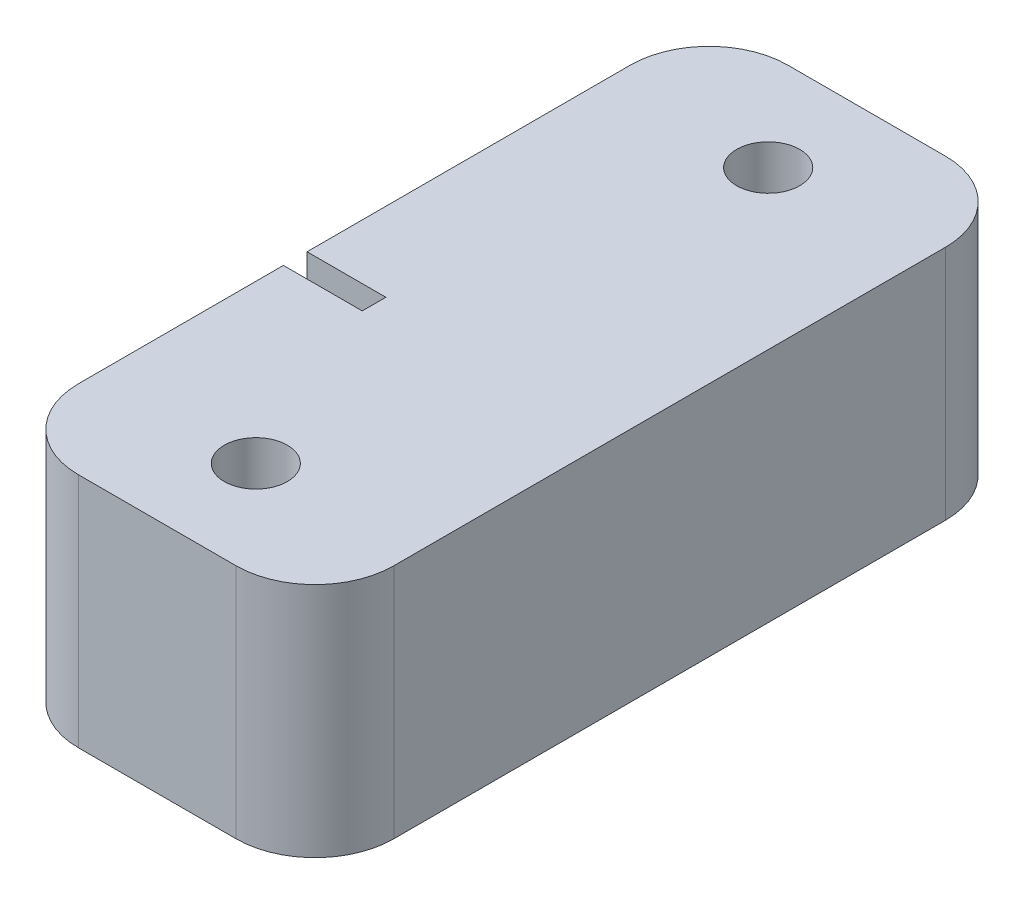
ISO-10303-21;
HEADER;
FILE_DESCRIPTION(('STEP AP214'),'2;1');
FILE_NAME('part.step','',(''),(''),'','','');
FILE_SCHEMA(('AUTOMOTIVE_DESIGN { 1 0 10303 214 1 1 1 1 }'));
ENDSEC;
DATA;
#1=APPLICATION_CONTEXT('core data for automotive mechanical design processes');
#2=APPLICATION_PROTOCOL_DEFINITION('international standard','automotive_design',2000,#1);
#3=PRODUCT_CONTEXT('',#1,'mechanical');
#4=PRODUCT('Part','Part','',(#3));
#5=PRODUCT_RELATED_PRODUCT_CATEGORY('part','',(#4));
#6=PRODUCT_DEFINITION_FORMATION('','',#4);
#7=PRODUCT_DEFINITION_CONTEXT('part definition',#1,'design');
#8=PRODUCT_DEFINITION('design','',#6,#7);
#9=PRODUCT_DEFINITION_SHAPE('','',#8);
#10=(LENGTH_UNIT() NAMED_UNIT(*) SI_UNIT(.MILLI.,.METRE.));
#11=(NAMED_UNIT(*) PLANE_ANGLE_UNIT() SI_UNIT($,.RADIAN.));
#12=(NAMED_UNIT(*) SI_UNIT($,.STERADIAN.) SOLID_ANGLE_UNIT());
#13=UNCERTAINTY_MEASURE_WITH_UNIT(LENGTH_MEASURE(1.E-05),#10,'distance_accuracy_value','');
#14=(GEOMETRIC_REPRESENTATION_CONTEXT(3) GLOBAL_UNCERTAINTY_ASSIGNED_CONTEXT((#13)) GLOBAL_UNIT_ASSIGNED_CONTEXT((#10,
#11,#12)) REPRESENTATION_CONTEXT('',''));
#15=CARTESIAN_POINT('',(0.,0.,0.));
#16=DIRECTION('',(0.,0.,1.));
#17=DIRECTION('',(1.,0.,0.));
#18=AXIS2_PLACEMENT_3D('',#15,#16,#17);
#19=CARTESIAN_POINT('',(-23.5223880597015,30.,-49.7611940298507));
#20=DIRECTION('',(1.,0.,0.));
#21=DIRECTION('',(0.,0.,-1.));
#22=AXIS2_PLACEMENT_3D('',#19,#20,#21);
#23=PLANE('',#22);
#24=DIRECTION('',(0.,0.,1.));
#25=VECTOR('',#24,1.);
#26=CARTESIAN_POINT('',(-23.5223880597015,30.,-49.7611940298507));
#27=LINE('',#26,#25);
#28=CARTESIAN_POINT('',(-23.5223880597015,30.,-39.7611940298507));
#29=VERTEX_POINT('',#28);
#30=CARTESIAN_POINT('',(-23.5223880597015,30.,1.23880597014926));
#31=VERTEX_POINT('',#30);
#32=EDGE_CURVE('E182',#29,#31,#27,.T.);
#33=ORIENTED_EDGE('',*,*,#32,.F.);
#34=DIRECTION('',(0.,-1.,0.));
#35=VECTOR('',#34,1.);
#36=CARTESIAN_POINT('',(-23.5223880597015,30.,-39.7611940298507));
#37=LINE('',#36,#35);
#38=CARTESIAN_POINT('',(-23.5223880597015,0.,-39.7611940298507));
#39=VERTEX_POINT('',#38);
#40=EDGE_CURVE('E204',#29,#39,#37,.T.);
#41=ORIENTED_EDGE('',*,*,#40,.T.);
#42=DIRECTION('',(0.,0.,1.));
#43=VECTOR('',#42,1.);
#44=CARTESIAN_POINT('',(-23.5223880597015,0.,-49.7611940298507));
#45=LINE('',#44,#43);
#46=CARTESIAN_POINT('',(-23.5223880597015,0.,30.2388059701492));
#47=VERTEX_POINT('',#46);
#48=EDGE_CURVE('E173',#39,#47,#45,.T.);
#49=ORIENTED_EDGE('',*,*,#48,.T.);
#50=DIRECTION('',(0.,-1.,0.));
#51=VECTOR('',#50,1.);
#52=CARTESIAN_POINT('',(-23.5223880597015,30.,30.2388059701492));
#53=LINE('',#52,#51);
#54=CARTESIAN_POINT('',(-23.5223880597015,30.,30.2388059701492));
#55=VERTEX_POINT('',#54);
#56=EDGE_CURVE('E192',#47,#55,#53,.F.);
#57=ORIENTED_EDGE('',*,*,#56,.T.);
#58=CARTESIAN_POINT('',(-23.5223880597015,30.,4.23880597014926));
#59=VERTEX_POINT('',#58);
#60=EDGE_CURVE('E185',#59,#55,#27,.T.);
#61=ORIENTED_EDGE('',*,*,#60,.F.);
#62=DIRECTION('',(0.,-1.,0.));
#63=VECTOR('',#62,1.);
#64=CARTESIAN_POINT('',(-23.5223880597015,0.,4.23880597014926));
#65=LINE('',#64,#63);
#66=CARTESIAN_POINT('',(-23.5223880597015,18.7080992435478,4.23880597014926));
#67=VERTEX_POINT('',#66);
#68=EDGE_CURVE('E151',#59,#67,#65,.T.);
#69=ORIENTED_EDGE('',*,*,#68,.T.);
#70=CARTESIAN_POINT('',(-23.5223880597015,15.,2.73880597014926));
#71=DIRECTION('',(-1.,0.,0.));
#72=DIRECTION('',(0.,0.,1.));
#73=AXIS2_PLACEMENT_3D('',#70,#71,#72);
#74=CIRCLE('',#73,4.);
#75=CARTESIAN_POINT('',(-23.5223880597015,18.7080992435478,1.23880597014926));
#76=VERTEX_POINT('',#75);
#77=EDGE_CURVE('E159',#76,#67,#74,.T.);
#78=ORIENTED_EDGE('',*,*,#77,.F.);
#79=DIRECTION('',(0.,-1.,0.));
#80=VECTOR('',#79,1.);
#81=CARTESIAN_POINT('',(-23.5223880597015,0.,1.23880597014926));
#82=LINE('',#81,#80);
#83=EDGE_CURVE('E129',#31,#76,#82,.T.);
#84=ORIENTED_EDGE('',*,*,#83,.F.);
#85=EDGE_LOOP('',(#33,#41,#49,#57,#61,#69,#78,#84));
#86=FACE_BOUND('',#85,.T.);
#87=ADVANCED_FACE('F32',(#86),#23,.F.);
#88=CARTESIAN_POINT('',(-23.5223880597015,30.,40.2388059701493));
#89=DIRECTION('',(0.,0.,-1.));
#90=DIRECTION('',(-1.,0.,0.));
#91=AXIS2_PLACEMENT_3D('',#88,#89,#90);
#92=PLANE('',#91);
#93=DIRECTION('',(1.,0.,0.));
#94=VECTOR('',#93,1.);
#95=CARTESIAN_POINT('',(-23.5223880597015,0.,40.2388059701493));
#96=LINE('',#95,#94);
#97=CARTESIAN_POINT('',(-13.5223880597015,0.,40.2388059701493));
#98=VERTEX_POINT('',#97);
#99=CARTESIAN_POINT('',(6.47761194029854,0.,40.2388059701493));
#100=VERTEX_POINT('',#99);
#101=EDGE_CURVE('E195',#98,#100,#96,.T.);
#102=ORIENTED_EDGE('',*,*,#101,.T.);
#103=DIRECTION('',(0.,-1.,0.));
#104=VECTOR('',#103,1.);
#105=CARTESIAN_POINT('',(6.47761194029854,30.,40.2388059701493));
#106=LINE('',#105,#104);
#107=CARTESIAN_POINT('',(6.47761194029854,30.,40.2388059701493));
#108=VERTEX_POINT('',#107);
#109=EDGE_CURVE('E11',#100,#108,#106,.F.);
#110=ORIENTED_EDGE('',*,*,#109,.T.);
#111=DIRECTION('',(1.,0.,0.));
#112=VECTOR('',#111,1.);
#113=CARTESIAN_POINT('',(-23.5223880597015,30.,40.2388059701493));
#114=LINE('',#113,#112);
#115=CARTESIAN_POINT('',(-13.5223880597015,30.,40.2388059701493));
#116=VERTEX_POINT('',#115);
#117=EDGE_CURVE('E184',#116,#108,#114,.T.);
#118=ORIENTED_EDGE('',*,*,#117,.F.);
#119=DIRECTION('',(0.,-1.,0.));
#120=VECTOR('',#119,1.);
#121=CARTESIAN_POINT('',(-13.5223880597015,30.,40.2388059701493));
#122=LINE('',#121,#120);
#123=EDGE_CURVE('E40',#116,#98,#122,.T.);
#124=ORIENTED_EDGE('',*,*,#123,.T.);
#125=EDGE_LOOP('',(#102,#110,#118,#124));
#126=FACE_BOUND('',#125,.T.);
#127=ADVANCED_FACE('F235',(#126),#92,.F.);
#128=CARTESIAN_POINT('',(16.4776119402985,30.,-49.7611940298507));
#129=DIRECTION('',(-1.,0.,0.));
#130=DIRECTION('',(0.,0.,1.));
#131=AXIS2_PLACEMENT_3D('',#128,#129,#130);
#132=PLANE('',#131);
#133=DIRECTION('',(0.,0.,-1.));
#134=VECTOR('',#133,1.);
#135=CARTESIAN_POINT('',(16.4776119402985,0.,-49.7611940298507));
#136=LINE('',#135,#134);
#137=CARTESIAN_POINT('',(16.4776119402985,0.,30.2388059701492));
#138=VERTEX_POINT('',#137);
#139=CARTESIAN_POINT('',(16.4776119402985,0.,-39.7611940298507));
#140=VERTEX_POINT('',#139);
#141=EDGE_CURVE('E198',#138,#140,#136,.T.);
#142=ORIENTED_EDGE('',*,*,#141,.T.);
#143=DIRECTION('',(0.,-1.,0.));
#144=VECTOR('',#143,1.);
#145=CARTESIAN_POINT('',(16.4776119402985,30.,-39.7611940298507));
#146=LINE('',#145,#144);
#147=CARTESIAN_POINT('',(16.4776119402985,30.,-39.7611940298507));
#148=VERTEX_POINT('',#147);
#149=EDGE_CURVE('E47',#140,#148,#146,.F.);
#150=ORIENTED_EDGE('',*,*,#149,.T.);
#151=DIRECTION('',(0.,0.,-1.));
#152=VECTOR('',#151,1.);
#153=CARTESIAN_POINT('',(16.4776119402985,30.,-49.7611940298507));
#154=LINE('',#153,#152);
#155=CARTESIAN_POINT('',(16.4776119402985,30.,30.2388059701492));
#156=VERTEX_POINT('',#155);
#157=EDGE_CURVE('E187',#156,#148,#154,.T.);
#158=ORIENTED_EDGE('',*,*,#157,.F.);
#159=DIRECTION('',(0.,-1.,0.));
#160=VECTOR('',#159,1.);
#161=CARTESIAN_POINT('',(16.4776119402985,30.,30.2388059701492));
#162=LINE('',#161,#160);
#163=EDGE_CURVE('E227',#156,#138,#162,.T.);
#164=ORIENTED_EDGE('',*,*,#163,.T.);
#165=EDGE_LOOP('',(#142,#150,#158,#164));
#166=FACE_BOUND('',#165,.T.);
#167=ADVANCED_FACE('F246',(#166),#132,.F.);
#168=CARTESIAN_POINT('',(-23.5223880597015,30.,-49.7611940298507));
#169=DIRECTION('',(0.,0.,1.));
#170=DIRECTION('',(1.,0.,0.));
#171=AXIS2_PLACEMENT_3D('',#168,#169,#170);
#172=PLANE('',#171);
#173=DIRECTION('',(-1.,0.,0.));
#174=VECTOR('',#173,1.);
#175=CARTESIAN_POINT('',(-23.5223880597015,0.,-49.7611940298507));
#176=LINE('',#175,#174);
#177=CARTESIAN_POINT('',(6.47761194029853,0.,-49.7611940298507));
#178=VERTEX_POINT('',#177);
#179=CARTESIAN_POINT('',(-13.5223880597015,0.,-49.7611940298507));
#180=VERTEX_POINT('',#179);
#181=EDGE_CURVE('E200',#178,#180,#176,.T.);
#182=ORIENTED_EDGE('',*,*,#181,.T.);
#183=DIRECTION('',(0.,-1.,0.));
#184=VECTOR('',#183,1.);
#185=CARTESIAN_POINT('',(-13.5223880597015,30.,-49.7611940298507));
#186=LINE('',#185,#184);
#187=CARTESIAN_POINT('',(-13.5223880597015,30.,-49.7611940298507));
#188=VERTEX_POINT('',#187);
#189=EDGE_CURVE('E218',#180,#188,#186,.F.);
#190=ORIENTED_EDGE('',*,*,#189,.T.);
#191=DIRECTION('',(-1.,0.,0.));
#192=VECTOR('',#191,1.);
#193=CARTESIAN_POINT('',(-23.5223880597015,30.,-49.7611940298507));
#194=LINE('',#193,#192);
#195=CARTESIAN_POINT('',(6.47761194029853,30.,-49.7611940298507));
#196=VERTEX_POINT('',#195);
#197=EDGE_CURVE('E189',#196,#188,#194,.T.);
#198=ORIENTED_EDGE('',*,*,#197,.F.);
#199=DIRECTION('',(0.,-1.,0.));
#200=VECTOR('',#199,1.);
#201=CARTESIAN_POINT('',(6.47761194029853,30.,-49.7611940298507));
#202=LINE('',#201,#200);
#203=EDGE_CURVE('E215',#196,#178,#202,.T.);
#204=ORIENTED_EDGE('',*,*,#203,.T.);
#205=EDGE_LOOP('',(#182,#190,#198,#204));
#206=FACE_BOUND('',#205,.T.);
#207=ADVANCED_FACE('F256',(#206),#172,.F.);
#208=CARTESIAN_POINT('',(0.,30.,0.));
#209=DIRECTION('',(0.,1.,0.));
#210=DIRECTION('',(0.,0.,1.));
#211=AXIS2_PLACEMENT_3D('',#208,#209,#210);
#212=PLANE('',#211);
#213=ORIENTED_EDGE('',*,*,#197,.T.);
#214=CARTESIAN_POINT('',(-13.5223880597015,30.,-39.7611940298507));
#215=DIRECTION('',(0.,1.,0.));
#216=DIRECTION('',(0.,0.,1.));
#217=AXIS2_PLACEMENT_3D('',#214,#215,#216);
#218=CIRCLE('',#217,10.);
#219=EDGE_CURVE('E225',#188,#29,#218,.T.);
#220=ORIENTED_EDGE('',*,*,#219,.T.);
#221=ORIENTED_EDGE('',*,*,#32,.T.);
#222=DIRECTION('',(-1.,0.,0.));
#223=VECTOR('',#222,1.);
#224=CARTESIAN_POINT('',(-13.5223880597015,30.,1.23880597014926));
#225=LINE('',#224,#223);
#226=CARTESIAN_POINT('',(-13.5223880597015,30.,1.23880597014926));
#227=VERTEX_POINT('',#226);
#228=EDGE_CURVE('E163',#227,#31,#225,.T.);
#229=ORIENTED_EDGE('',*,*,#228,.F.);
#230=DIRECTION('',(0.,0.,-1.));
#231=VECTOR('',#230,1.);
#232=CARTESIAN_POINT('',(-13.5223880597015,30.,0.));
#233=LINE('',#232,#231);
#234=CARTESIAN_POINT('',(-13.5223880597015,30.,4.23880597014926));
#235=VERTEX_POINT('',#234);
#236=EDGE_CURVE('E146',#235,#227,#233,.T.);
#237=ORIENTED_EDGE('',*,*,#236,.F.);
#238=DIRECTION('',(-1.,0.,0.));
#239=VECTOR('',#238,1.);
#240=CARTESIAN_POINT('',(-13.5223880597015,30.,4.23880597014926));
#241=LINE('',#240,#239);
#242=EDGE_CURVE('E166',#235,#59,#241,.T.);
#243=ORIENTED_EDGE('',*,*,#242,.T.);
#244=ORIENTED_EDGE('',*,*,#60,.T.);
#245=CARTESIAN_POINT('',(-13.5223880597015,30.,30.2388059701493));
#246=DIRECTION('',(0.,1.,0.));
#247=DIRECTION('',(0.,0.,1.));
#248=AXIS2_PLACEMENT_3D('',#245,#246,#247);
#249=CIRCLE('',#248,10.);
#250=EDGE_CURVE('E220',#55,#116,#249,.T.);
#251=ORIENTED_EDGE('',*,*,#250,.T.);
#252=ORIENTED_EDGE('',*,*,#117,.T.);
#253=CARTESIAN_POINT('',(6.47761194029854,30.,30.2388059701492));
#254=DIRECTION('',(0.,1.,0.));
#255=DIRECTION('',(0.,0.,1.));
#256=AXIS2_PLACEMENT_3D('',#253,#254,#255);
#257=CIRCLE('',#256,10.);
#258=EDGE_CURVE('E54',#108,#156,#257,.T.);
#259=ORIENTED_EDGE('',*,*,#258,.T.);
#260=ORIENTED_EDGE('',*,*,#157,.T.);
#261=CARTESIAN_POINT('',(6.47761194029853,30.,-39.7611940298507));
#262=DIRECTION('',(0.,1.,0.));
#263=DIRECTION('',(0.,0.,1.));
#264=AXIS2_PLACEMENT_3D('',#261,#262,#263);
#265=CIRCLE('',#264,10.);
#266=EDGE_CURVE('E223',#148,#196,#265,.T.);
#267=ORIENTED_EDGE('',*,*,#266,.T.);
#268=EDGE_LOOP('',(#213,#220,#221,#229,#237,#243,#244,#251,#252,#259,#260,#267));
#269=FACE_BOUND('',#268,.T.);
#270=CARTESIAN_POINT('',(-3.52238805970146,30.,-37.2611940298507));
#271=DIRECTION('',(0.,1.,0.));
#272=DIRECTION('',(0.,0.,1.));
#273=AXIS2_PLACEMENT_3D('',#270,#271,#272);
#274=CIRCLE('',#273,4.);
#275=CARTESIAN_POINT('',(-3.52238805970146,30.,-33.2611940298507));
#276=VERTEX_POINT('',#275);
#277=EDGE_CURVE('E174',#276,#276,#274,.T.);
#278=ORIENTED_EDGE('',*,*,#277,.F.);
#279=EDGE_LOOP('',(#278));
#280=FACE_BOUND('',#279,.T.);
#281=CARTESIAN_POINT('',(-3.52238805970146,30.,27.7388059701493));
#282=DIRECTION('',(0.,1.,0.));
#283=DIRECTION('',(0.,0.,1.));
#284=AXIS2_PLACEMENT_3D('',#281,#282,#283);
#285=CIRCLE('',#284,4.);
#286=CARTESIAN_POINT('',(-3.52238805970146,30.,31.7388059701493));
#287=VERTEX_POINT('',#286);
#288=EDGE_CURVE('E165',#287,#287,#285,.T.);
#289=ORIENTED_EDGE('',*,*,#288,.F.);
#290=EDGE_LOOP('',(#289));
#291=FACE_BOUND('',#290,.T.);
#292=ADVANCED_FACE('F248',(#269,#280,#291),#212,.T.);
#293=CARTESIAN_POINT('',(0.,0.,0.));
#294=DIRECTION('',(0.,1.,0.));
#295=DIRECTION('',(0.,0.,1.));
#296=AXIS2_PLACEMENT_3D('',#293,#294,#295);
#297=PLANE('',#296);
#298=ORIENTED_EDGE('',*,*,#48,.F.);
#299=CARTESIAN_POINT('',(-13.5223880597015,0.,-39.7611940298507));
#300=DIRECTION('',(0.,1.,0.));
#301=DIRECTION('',(0.,0.,1.));
#302=AXIS2_PLACEMENT_3D('',#299,#300,#301);
#303=CIRCLE('',#302,10.);
#304=EDGE_CURVE('E213',#39,#180,#303,.F.);
#305=ORIENTED_EDGE('',*,*,#304,.T.);
#306=ORIENTED_EDGE('',*,*,#181,.F.);
#307=CARTESIAN_POINT('',(6.47761194029853,0.,-39.7611940298507));
#308=DIRECTION('',(0.,1.,0.));
#309=DIRECTION('',(0.,0.,1.));
#310=AXIS2_PLACEMENT_3D('',#307,#308,#309);
#311=CIRCLE('',#310,10.);
#312=EDGE_CURVE('E211',#178,#140,#311,.F.);
#313=ORIENTED_EDGE('',*,*,#312,.T.);
#314=ORIENTED_EDGE('',*,*,#141,.F.);
#315=CARTESIAN_POINT('',(6.47761194029854,0.,30.2388059701492));
#316=DIRECTION('',(0.,1.,0.));
#317=DIRECTION('',(0.,0.,1.));
#318=AXIS2_PLACEMENT_3D('',#315,#316,#317);
#319=CIRCLE('',#318,10.);
#320=EDGE_CURVE('E209',#138,#100,#319,.F.);
#321=ORIENTED_EDGE('',*,*,#320,.T.);
#322=ORIENTED_EDGE('',*,*,#101,.F.);
#323=CARTESIAN_POINT('',(-13.5223880597015,0.,30.2388059701493));
#324=DIRECTION('',(0.,1.,0.));
#325=DIRECTION('',(0.,0.,1.));
#326=AXIS2_PLACEMENT_3D('',#323,#324,#325);
#327=CIRCLE('',#326,10.);
#328=EDGE_CURVE('E207',#98,#47,#327,.F.);
#329=ORIENTED_EDGE('',*,*,#328,.T.);
#330=EDGE_LOOP('',(#298,#305,#306,#313,#314,#321,#322,#329));
#331=FACE_BOUND('',#330,.T.);
#332=ADVANCED_FACE('F241',(#331),#297,.F.);
#333=CARTESIAN_POINT('',(-3.52238805970146,10.,27.7388059701493));
#334=DIRECTION('',(0.,1.,0.));
#335=DIRECTION('',(0.,0.,1.));
#336=AXIS2_PLACEMENT_3D('',#333,#334,#335);
#337=CYLINDRICAL_SURFACE('',#336,4.);
#338=CARTESIAN_POINT('',(-3.52238805970146,10.,27.7388059701493));
#339=DIRECTION('',(0.,1.,0.));
#340=DIRECTION('',(0.,0.,1.));
#341=AXIS2_PLACEMENT_3D('',#338,#339,#340);
#342=CIRCLE('',#341,4.);
#343=CARTESIAN_POINT('',(-3.52238805970146,10.,31.7388059701493));
#344=VERTEX_POINT('',#343);
#345=EDGE_CURVE('E177',#344,#344,#342,.T.);
#346=ORIENTED_EDGE('',*,*,#345,.F.);
#347=EDGE_LOOP('',(#346));
#348=FACE_BOUND('',#347,.T.);
#349=ORIENTED_EDGE('',*,*,#288,.T.);
#350=EDGE_LOOP('',(#349));
#351=FACE_BOUND('',#350,.T.);
#352=ADVANCED_FACE('F315',(#348,#351),#337,.F.);
#353=CARTESIAN_POINT('',(-3.52238805970146,10.,27.7388059701493));
#354=DIRECTION('',(0.,1.,0.));
#355=DIRECTION('',(0.,0.,1.));
#356=AXIS2_PLACEMENT_3D('',#353,#354,#355);
#357=PLANE('',#356);
#358=ORIENTED_EDGE('',*,*,#345,.T.);
#359=EDGE_LOOP('',(#358));
#360=FACE_BOUND('',#359,.T.);
#361=ADVANCED_FACE('F311',(#360),#357,.T.);
#362=CARTESIAN_POINT('',(-3.52238805970146,10.,-37.2611940298507));
#363=DIRECTION('',(0.,1.,0.));
#364=DIRECTION('',(0.,0.,1.));
#365=AXIS2_PLACEMENT_3D('',#362,#363,#364);
#366=CYLINDRICAL_SURFACE('',#365,4.);
#367=CARTESIAN_POINT('',(-3.52238805970146,10.,-37.2611940298507));
#368=DIRECTION('',(0.,1.,0.));
#369=DIRECTION('',(0.,0.,1.));
#370=AXIS2_PLACEMENT_3D('',#367,#368,#369);
#371=CIRCLE('',#370,4.);
#372=CARTESIAN_POINT('',(-3.52238805970146,10.,-33.2611940298507));
#373=VERTEX_POINT('',#372);
#374=EDGE_CURVE('E170',#373,#373,#371,.T.);
#375=ORIENTED_EDGE('',*,*,#374,.F.);
#376=EDGE_LOOP('',(#375));
#377=FACE_BOUND('',#376,.T.);
#378=ORIENTED_EDGE('',*,*,#277,.T.);
#379=EDGE_LOOP('',(#378));
#380=FACE_BOUND('',#379,.T.);
#381=ADVANCED_FACE('F307',(#377,#380),#366,.F.);
#382=CARTESIAN_POINT('',(-3.52238805970146,10.,-37.2611940298507));
#383=DIRECTION('',(0.,1.,0.));
#384=DIRECTION('',(0.,0.,1.));
#385=AXIS2_PLACEMENT_3D('',#382,#383,#384);
#386=PLANE('',#385);
#387=ORIENTED_EDGE('',*,*,#374,.T.);
#388=EDGE_LOOP('',(#387));
#389=FACE_BOUND('',#388,.T.);
#390=ADVANCED_FACE('F304',(#389),#386,.T.);
#391=CARTESIAN_POINT('',(-13.5223880597015,0.,1.23880597014926));
#392=DIRECTION('',(0.,0.,-1.));
#393=DIRECTION('',(-1.,0.,0.));
#394=AXIS2_PLACEMENT_3D('',#391,#392,#393);
#395=PLANE('',#394);
#396=ORIENTED_EDGE('',*,*,#83,.T.);
#397=DIRECTION('',(-1.,0.,0.));
#398=VECTOR('',#397,1.);
#399=CARTESIAN_POINT('',(-13.5223880597015,18.7080992435478,1.23880597014926));
#400=LINE('',#399,#398);
#401=CARTESIAN_POINT('',(-13.5223880597015,18.7080992435478,1.23880597014926));
#402=VERTEX_POINT('',#401);
#403=EDGE_CURVE('E121',#402,#76,#400,.T.);
#404=ORIENTED_EDGE('',*,*,#403,.F.);
#405=DIRECTION('',(0.,-1.,0.));
#406=VECTOR('',#405,1.);
#407=CARTESIAN_POINT('',(-13.5223880597015,0.,1.23880597014926));
#408=LINE('',#407,#406);
#409=EDGE_CURVE('E126',#227,#402,#408,.T.);
#410=ORIENTED_EDGE('',*,*,#409,.F.);
#411=ORIENTED_EDGE('',*,*,#228,.T.);
#412=EDGE_LOOP('',(#396,#404,#410,#411));
#413=FACE_BOUND('',#412,.T.);
#414=ADVANCED_FACE('F123',(#413),#395,.F.);
#415=CARTESIAN_POINT('',(-13.5223880597015,0.,4.23880597014926));
#416=DIRECTION('',(0.,0.,-1.));
#417=DIRECTION('',(0.,1.,0.));
#418=AXIS2_PLACEMENT_3D('',#415,#416,#417);
#419=PLANE('',#418);
#420=ORIENTED_EDGE('',*,*,#68,.F.);
#421=ORIENTED_EDGE('',*,*,#242,.F.);
#422=DIRECTION('',(0.,-1.,0.));
#423=VECTOR('',#422,1.);
#424=CARTESIAN_POINT('',(-13.5223880597015,0.,4.23880597014926));
#425=LINE('',#424,#423);
#426=CARTESIAN_POINT('',(-13.5223880597015,18.7080992435478,4.23880597014926));
#427=VERTEX_POINT('',#426);
#428=EDGE_CURVE('E141',#235,#427,#425,.T.);
#429=ORIENTED_EDGE('',*,*,#428,.T.);
#430=DIRECTION('',(-1.,0.,0.));
#431=VECTOR('',#430,1.);
#432=CARTESIAN_POINT('',(-13.5223880597015,18.7080992435478,4.23880597014926));
#433=LINE('',#432,#431);
#434=EDGE_CURVE('E133',#427,#67,#433,.T.);
#435=ORIENTED_EDGE('',*,*,#434,.T.);
#436=EDGE_LOOP('',(#420,#421,#429,#435));
#437=FACE_BOUND('',#436,.T.);
#438=ADVANCED_FACE('F297',(#437),#419,.T.);
#439=CARTESIAN_POINT('',(-13.5223880597015,15.,2.73880597014926));
#440=DIRECTION('',(-1.,0.,0.));
#441=DIRECTION('',(0.,0.,1.));
#442=AXIS2_PLACEMENT_3D('',#439,#440,#441);
#443=CYLINDRICAL_SURFACE('',#442,4.);
#444=ORIENTED_EDGE('',*,*,#77,.T.);
#445=ORIENTED_EDGE('',*,*,#434,.F.);
#446=CARTESIAN_POINT('',(-13.5223880597015,15.,2.73880597014926));
#447=DIRECTION('',(-1.,0.,0.));
#448=DIRECTION('',(0.,0.,1.));
#449=AXIS2_PLACEMENT_3D('',#446,#447,#448);
#450=CIRCLE('',#449,4.);
#451=EDGE_CURVE('E138',#402,#427,#450,.T.);
#452=ORIENTED_EDGE('',*,*,#451,.F.);
#453=ORIENTED_EDGE('',*,*,#403,.T.);
#454=EDGE_LOOP('',(#444,#445,#452,#453));
#455=FACE_BOUND('',#454,.T.);
#456=ADVANCED_FACE('F139',(#455),#443,.F.);
#457=CARTESIAN_POINT('',(-13.5223880597015,15.,2.73880597014926));
#458=DIRECTION('',(-1.,0.,0.));
#459=DIRECTION('',(0.,0.,1.));
#460=AXIS2_PLACEMENT_3D('',#457,#458,#459);
#461=CYLINDRICAL_SURFACE('',#460,2.5);
#462=CARTESIAN_POINT('',(-13.5223880597015,15.,2.73880597014926));
#463=DIRECTION('',(-1.,0.,0.));
#464=DIRECTION('',(0.,0.,1.));
#465=AXIS2_PLACEMENT_3D('',#462,#463,#464);
#466=CIRCLE('',#465,2.5);
#467=CARTESIAN_POINT('',(-13.5223880597015,15.,5.23880597014926));
#468=VERTEX_POINT('',#467);
#469=EDGE_CURVE('E134',#468,#468,#466,.T.);
#470=ORIENTED_EDGE('',*,*,#469,.T.);
#471=EDGE_LOOP('',(#470));
#472=FACE_BOUND('',#471,.T.);
#473=CARTESIAN_POINT('',(-23.5223880597015,15.,2.73880597014926));
#474=DIRECTION('',(-1.,0.,0.));
#475=DIRECTION('',(0.,0.,1.));
#476=AXIS2_PLACEMENT_3D('',#473,#474,#475);
#477=CIRCLE('',#476,2.5);
#478=CARTESIAN_POINT('',(-23.5223880597015,15.,5.23880597014926));
#479=VERTEX_POINT('',#478);
#480=EDGE_CURVE('E148',#479,#479,#477,.T.);
#481=ORIENTED_EDGE('',*,*,#480,.F.);
#482=EDGE_LOOP('',(#481));
#483=FACE_BOUND('',#482,.T.);
#484=ADVANCED_FACE('F287',(#472,#483),#461,.T.);
#485=CARTESIAN_POINT('',(-13.5223880597015,0.,0.));
#486=DIRECTION('',(-1.,0.,0.));
#487=DIRECTION('',(0.,0.,1.));
#488=AXIS2_PLACEMENT_3D('',#485,#486,#487);
#489=PLANE('',#488);
#490=ORIENTED_EDGE('',*,*,#409,.T.);
#491=ORIENTED_EDGE('',*,*,#451,.T.);
#492=ORIENTED_EDGE('',*,*,#428,.F.);
#493=ORIENTED_EDGE('',*,*,#236,.T.);
#494=EDGE_LOOP('',(#490,#491,#492,#493));
#495=FACE_BOUND('',#494,.T.);
#496=ORIENTED_EDGE('',*,*,#469,.F.);
#497=EDGE_LOOP('',(#496));
#498=FACE_BOUND('',#497,.T.);
#499=ADVANCED_FACE('F143',(#495,#498),#489,.T.);
#500=ORIENTED_EDGE('',*,*,#480,.T.);
#501=EDGE_LOOP('',(#500));
#502=FACE_BOUND('',#501,.T.);
#503=ADVANCED_FACE('F275',(#502),#23,.F.);
#504=CARTESIAN_POINT('',(-13.5223880597015,30.,-39.7611940298507));
#505=DIRECTION('',(0.,-1.,0.));
#506=DIRECTION('',(0.,0.,-1.));
#507=AXIS2_PLACEMENT_3D('',#504,#505,#506);
#508=CYLINDRICAL_SURFACE('',#507,10.);
#509=ORIENTED_EDGE('',*,*,#219,.F.);
#510=ORIENTED_EDGE('',*,*,#189,.F.);
#511=ORIENTED_EDGE('',*,*,#304,.F.);
#512=ORIENTED_EDGE('',*,*,#40,.F.);
#513=EDGE_LOOP('',(#509,#510,#511,#512));
#514=FACE_BOUND('',#513,.T.);
#515=ADVANCED_FACE('F261',(#514),#508,.T.);
#516=CARTESIAN_POINT('',(6.47761194029853,30.,-39.7611940298507));
#517=DIRECTION('',(0.,-1.,0.));
#518=DIRECTION('',(0.,0.,-1.));
#519=AXIS2_PLACEMENT_3D('',#516,#517,#518);
#520=CYLINDRICAL_SURFACE('',#519,10.);
#521=ORIENTED_EDGE('',*,*,#266,.F.);
#522=ORIENTED_EDGE('',*,*,#149,.F.);
#523=ORIENTED_EDGE('',*,*,#312,.F.);
#524=ORIENTED_EDGE('',*,*,#203,.F.);
#525=EDGE_LOOP('',(#521,#522,#523,#524));
#526=FACE_BOUND('',#525,.T.);
#527=ADVANCED_FACE('F253',(#526),#520,.T.);
#528=CARTESIAN_POINT('',(6.47761194029854,30.,30.2388059701492));
#529=DIRECTION('',(0.,-1.,0.));
#530=DIRECTION('',(0.,0.,-1.));
#531=AXIS2_PLACEMENT_3D('',#528,#529,#530);
#532=CYLINDRICAL_SURFACE('',#531,10.);
#533=ORIENTED_EDGE('',*,*,#258,.F.);
#534=ORIENTED_EDGE('',*,*,#109,.F.);
#535=ORIENTED_EDGE('',*,*,#320,.F.);
#536=ORIENTED_EDGE('',*,*,#163,.F.);
#537=EDGE_LOOP('',(#533,#534,#535,#536));
#538=FACE_BOUND('',#537,.T.);
#539=ADVANCED_FACE('F245',(#538),#532,.T.);
#540=CARTESIAN_POINT('',(-13.5223880597015,30.,30.2388059701493));
#541=DIRECTION('',(0.,-1.,0.));
#542=DIRECTION('',(0.,0.,-1.));
#543=AXIS2_PLACEMENT_3D('',#540,#541,#542);
#544=CYLINDRICAL_SURFACE('',#543,10.);
#545=ORIENTED_EDGE('',*,*,#250,.F.);
#546=ORIENTED_EDGE('',*,*,#56,.F.);
#547=ORIENTED_EDGE('',*,*,#328,.F.);
#548=ORIENTED_EDGE('',*,*,#123,.F.);
#549=EDGE_LOOP('',(#545,#546,#547,#548));
#550=FACE_BOUND('',#549,.T.);
#551=ADVANCED_FACE('F34',(#550),#544,.T.);
#552=CLOSED_SHELL('',(#87,#127,#167,#207,#292,#332,#352,#361,#381,#390,#414,#438,#456,#484,#499,
#503,#515,#527,#539,#551));
#553=MANIFOLD_SOLID_BREP('B2',#552);
#554=ADVANCED_BREP_SHAPE_REPRESENTATION('',(#18,#553),#14);
#555=SHAPE_DEFINITION_REPRESENTATION(#9,#554);
ENDSEC;
END-ISO-10303-21;
